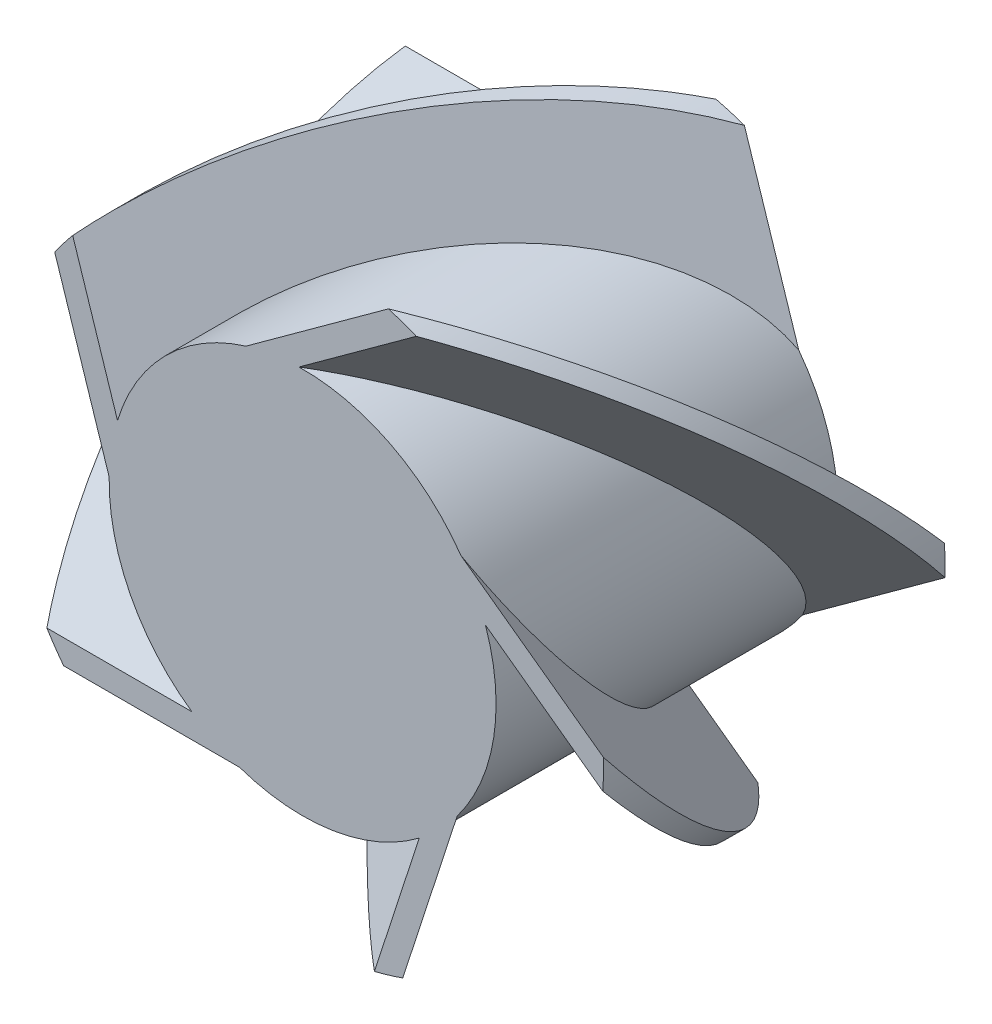
ISO-10303-21;
HEADER;
FILE_DESCRIPTION(('STEP AP214'),'2;1');
FILE_NAME('part.step','',(''),(''),'','','');
FILE_SCHEMA(('AUTOMOTIVE_DESIGN { 1 0 10303 214 1 1 1 1 }'));
ENDSEC;
DATA;
#1=APPLICATION_CONTEXT('core data for automotive mechanical design processes');
#2=APPLICATION_PROTOCOL_DEFINITION('international standard','automotive_design',2000,#1);
#3=PRODUCT_CONTEXT('',#1,'mechanical');
#4=PRODUCT('Part','Part','',(#3));
#5=PRODUCT_RELATED_PRODUCT_CATEGORY('part','',(#4));
#6=PRODUCT_DEFINITION_FORMATION('','',#4);
#7=PRODUCT_DEFINITION_CONTEXT('part definition',#1,'design');
#8=PRODUCT_DEFINITION('design','',#6,#7);
#9=PRODUCT_DEFINITION_SHAPE('','',#8);
#10=(LENGTH_UNIT() NAMED_UNIT(*) SI_UNIT(.MILLI.,.METRE.));
#11=(NAMED_UNIT(*) PLANE_ANGLE_UNIT() SI_UNIT($,.RADIAN.));
#12=(NAMED_UNIT(*) SI_UNIT($,.STERADIAN.) SOLID_ANGLE_UNIT());
#13=UNCERTAINTY_MEASURE_WITH_UNIT(LENGTH_MEASURE(1.E-05),#10,'distance_accuracy_value','');
#14=(GEOMETRIC_REPRESENTATION_CONTEXT(3) GLOBAL_UNCERTAINTY_ASSIGNED_CONTEXT((#13)) GLOBAL_UNIT_ASSIGNED_CONTEXT((#10,
#11,#12)) REPRESENTATION_CONTEXT('',''));
#15=CARTESIAN_POINT('',(0.,0.,0.));
#16=DIRECTION('',(0.,0.,1.));
#17=DIRECTION('',(1.,0.,0.));
#18=AXIS2_PLACEMENT_3D('',#15,#16,#17);
#19=CARTESIAN_POINT('',(13.0974737134332,10.2910778197719,47.7012));
#20=DIRECTION('',(0.,0.,1.));
#21=DIRECTION('',(1.,0.,0.));
#22=AXIS2_PLACEMENT_3D('',#19,#20,#21);
#23=PLANE('',#22);
#24=CARTESIAN_POINT('',(31.496,30.988,47.7012));
#25=DIRECTION('',(0.,0.,1.));
#26=DIRECTION('',(1.,0.,0.));
#27=AXIS2_PLACEMENT_3D('',#24,#25,#26);
#28=CIRCLE('',#27,17.78);
#29=CARTESIAN_POINT('',(37.4130205696061,14.2214479519831,47.7012));
#30=VERTEX_POINT('',#29);
#31=CARTESIAN_POINT('',(35.7399307124631,13.721921924542,47.7012));
#32=VERTEX_POINT('',#31);
#33=EDGE_CURVE('E251',#30,#32,#28,.F.);
#34=ORIENTED_EDGE('',*,*,#33,.F.);
#35=DIRECTION('',(-0.30901699437494,-0.951056516295156,0.));
#36=VECTOR('',#35,1.);
#37=CARTESIAN_POINT('',(38.4614674875628,17.448235770981,47.7012));
#38=LINE('',#37,#36);
#39=CARTESIAN_POINT('',(40.6267949705005,24.1124285178116,47.7012));
#40=VERTEX_POINT('',#39);
#41=EDGE_CURVE('E167',#40,#30,#38,.T.);
#42=ORIENTED_EDGE('',*,*,#41,.F.);
#43=CARTESIAN_POINT('',(31.496,30.988,47.7012));
#44=DIRECTION('',(0.,0.,1.));
#45=DIRECTION('',(0.,-1.,0.));
#46=AXIS2_PLACEMENT_3D('',#43,#44,#45);
#47=CIRCLE('',#46,11.43);
#48=CARTESIAN_POINT('',(42.2982554358267,34.7237967689843,47.7012));
#49=VERTEX_POINT('',#48);
#50=EDGE_CURVE('E151',#49,#40,#47,.F.);
#51=ORIENTED_EDGE('',*,*,#50,.F.);
#52=DIRECTION('',(-0.809016994374946,0.587785252292475,0.));
#53=VECTOR('',#52,1.);
#54=CARTESIAN_POINT('',(44.8765476119103,32.850557853436,47.7012));
#55=LINE('',#54,#53);
#56=CARTESIAN_POINT('',(49.2284627776261,29.688706407272,47.7012));
#57=VERTEX_POINT('',#56);
#58=EDGE_CURVE('E165',#57,#49,#55,.T.);
#59=ORIENTED_EDGE('',*,*,#58,.F.);
#60=CARTESIAN_POINT('',(31.496,30.988,47.7012));
#61=DIRECTION('',(0.,0.,1.));
#62=DIRECTION('',(1.,0.,0.));
#63=AXIS2_PLACEMENT_3D('',#60,#61,#62);
#64=CIRCLE('',#63,17.78);
#65=CARTESIAN_POINT('',(49.2703984931427,31.4342714498669,47.7012));
#66=VERTEX_POINT('',#65);
#67=EDGE_CURVE('E257',#66,#57,#64,.F.);
#68=ORIENTED_EDGE('',*,*,#67,.F.);
#69=DIRECTION('',(0.809016994374948,-0.587785252292472,0.));
#70=VECTOR('',#69,1.);
#71=CARTESIAN_POINT('',(45.9521577980181,33.845114433033,47.7012));
#72=LINE('',#71,#70);
#73=CARTESIAN_POINT('',(40.8566278794263,37.5472336216136,47.7012));
#74=VERTEX_POINT('',#73);
#75=EDGE_CURVE('E177',#74,#66,#72,.T.);
#76=ORIENTED_EDGE('',*,*,#75,.F.);
#77=CARTESIAN_POINT('',(31.496,30.988,47.7012));
#78=DIRECTION('',(0.,0.,1.));
#79=DIRECTION('',(1.,0.,0.));
#80=AXIS2_PLACEMENT_3D('',#77,#78,#79);
#81=CIRCLE('',#80,11.43);
#82=CARTESIAN_POINT('',(31.2811266465527,42.4159801120749,47.7012));
#83=VERTEX_POINT('',#82);
#84=EDGE_CURVE('E20',#74,#83,#81,.T.);
#85=ORIENTED_EDGE('',*,*,#84,.T.);
#86=DIRECTION('',(-0.809016994374949,-0.587785252292471,0.));
#87=VECTOR('',#86,1.);
#88=CARTESIAN_POINT('',(34.0904750711804,44.4570912185518,47.7012));
#89=LINE('',#88,#87);
#90=CARTESIAN_POINT('',(38.2113339883522,47.4510704737872,47.7012));
#91=VERTEX_POINT('',#90);
#92=EDGE_CURVE('E263',#91,#83,#89,.T.);
#93=ORIENTED_EDGE('',*,*,#92,.F.);
#94=CARTESIAN_POINT('',(31.496,30.988,47.7012));
#95=DIRECTION('',(0.,0.,1.));
#96=DIRECTION('',(0.,-1.,0.));
#97=AXIS2_PLACEMENT_3D('',#94,#95,#96);
#98=CIRCLE('',#97,17.78);
#99=CARTESIAN_POINT('',(36.5641618287412,48.0303629722433,47.7012));
#100=VERTEX_POINT('',#99);
#101=EDGE_CURVE('E301',#91,#100,#98,.T.);
#102=ORIENTED_EDGE('',*,*,#101,.T.);
#103=DIRECTION('',(0.809016994374949,0.587785252292471,0.));
#104=VECTOR('',#103,1.);
#105=CARTESIAN_POINT('',(33.0148648850726,45.4516477981487,47.7012));
#106=LINE('',#105,#104);
#107=CARTESIAN_POINT('',(28.1503912150248,41.9174008004967,47.7012));
#108=VERTEX_POINT('',#107);
#109=EDGE_CURVE('E272',#108,#100,#106,.T.);
#110=ORIENTED_EDGE('',*,*,#109,.F.);
#111=CARTESIAN_POINT('',(31.496,30.988,47.7012));
#112=DIRECTION('',(0.,0.,1.));
#113=DIRECTION('',(0.,-1.,0.));
#114=AXIS2_PLACEMENT_3D('',#111,#112,#113);
#115=CIRCLE('',#114,11.43);
#116=CARTESIAN_POINT('',(20.5609455284663,34.3150833630358,47.7012));
#117=VERTEX_POINT('',#116);
#118=EDGE_CURVE('E273',#117,#108,#115,.F.);
#119=ORIENTED_EDGE('',*,*,#118,.F.);
#120=DIRECTION('',(0.309016994374947,-0.951056516295154,0.));
#121=VECTOR('',#120,1.);
#122=CARTESIAN_POINT('',(19.2688616717718,38.2917085774343,47.7012));
#123=LINE('',#122,#121);
#124=CARTESIAN_POINT('',(17.9138418729829,42.4620307047133,47.7012));
#125=VERTEX_POINT('',#124);
#126=EDGE_CURVE('E279',#125,#117,#123,.T.);
#127=ORIENTED_EDGE('',*,*,#126,.F.);
#128=CARTESIAN_POINT('',(31.496,30.988,47.7012));
#129=DIRECTION('',(0.,0.,1.));
#130=DIRECTION('',(1.,0.,0.));
#131=AXIS2_PLACEMENT_3D('',#128,#129,#130);
#132=CIRCLE('',#131,17.78);
#133=CARTESIAN_POINT('',(16.8538977775041,41.0744881155921,47.7012));
#134=VERTEX_POINT('',#133);
#135=EDGE_CURVE('E283',#134,#125,#132,.F.);
#136=ORIENTED_EDGE('',*,*,#135,.F.);
#137=DIRECTION('',(-0.309016994374948,0.951056516295153,0.));
#138=VECTOR('',#137,1.);
#139=CARTESIAN_POINT('',(18.2110260043969,36.8976769138484,47.7012));
#140=LINE('',#139,#138);
#141=CARTESIAN_POINT('',(20.0676721783987,31.1835075497634,47.7012));
#142=VERTEX_POINT('',#141);
#143=EDGE_CURVE('E288',#142,#134,#140,.T.);
#144=ORIENTED_EDGE('',*,*,#143,.F.);
#145=CARTESIAN_POINT('',(31.496,30.988,47.7012));
#146=DIRECTION('',(0.,0.,1.));
#147=DIRECTION('',(0.,-1.,0.));
#148=AXIS2_PLACEMENT_3D('',#145,#146,#147);
#149=CIRCLE('',#148,11.43);
#150=CARTESIAN_POINT('',(24.952638021208,21.6162704896855,47.7012));
#151=VERTEX_POINT('',#150);
#152=EDGE_CURVE('E294',#151,#142,#149,.F.);
#153=ORIENTED_EDGE('',*,*,#152,.F.);
#154=DIRECTION('',(1.,0.,0.));
#155=VECTOR('',#154,1.);
#156=CARTESIAN_POINT('',(20.7472568783248,21.6162704896855,47.7012));
#157=LINE('',#156,#155);
#158=CARTESIAN_POINT('',(16.3864306485757,21.6162704896855,47.7012));
#159=VERTEX_POINT('',#158);
#160=EDGE_CURVE('E296',#159,#151,#157,.T.);
#161=ORIENTED_EDGE('',*,*,#160,.F.);
#162=CARTESIAN_POINT('',(31.496,30.988,47.7012));
#163=DIRECTION('',(0.,0.,1.));
#164=DIRECTION('',(1.,0.,0.));
#165=AXIS2_PLACEMENT_3D('',#162,#163,#164);
#166=CIRCLE('',#165,17.78);
#167=CARTESIAN_POINT('',(17.3785213310061,20.1794295103145,47.7012));
#168=VERTEX_POINT('',#167);
#169=EDGE_CURVE('E300',#168,#159,#166,.F.);
#170=ORIENTED_EDGE('',*,*,#169,.F.);
#171=DIRECTION('',(-1.,0.,0.));
#172=VECTOR('',#171,1.);
#173=CARTESIAN_POINT('',(20.7472568783248,20.1794295103144,47.7012));
#174=LINE('',#173,#172);
#175=CARTESIAN_POINT('',(27.7785137566497,20.1794295103145,47.7012));
#176=VERTEX_POINT('',#175);
#177=EDGE_CURVE('E185',#176,#168,#174,.T.);
#178=ORIENTED_EDGE('',*,*,#177,.F.);
#179=CARTESIAN_POINT('',(31.496,30.988,47.7012));
#180=DIRECTION('',(0.,0.,1.));
#181=DIRECTION('',(0.,-1.,0.));
#182=AXIS2_PLACEMENT_3D('',#179,#180,#181);
#183=CIRCLE('',#182,11.43);
#184=CARTESIAN_POINT('',(38.3870343679465,21.8688692662195,47.7012));
#185=VERTEX_POINT('',#184);
#186=EDGE_CURVE('E189',#185,#176,#183,.F.);
#187=ORIENTED_EDGE('',*,*,#186,.F.);
#188=DIRECTION('',(0.309016994374948,0.951056516295153,0.));
#189=VECTOR('',#188,1.);
#190=CARTESIAN_POINT('',(37.403631820188,18.8422674345668,47.7012000000001));
#191=LINE('',#190,#189);
#192=EDGE_CURVE('E181',#32,#185,#191,.T.);
#193=ORIENTED_EDGE('',*,*,#192,.F.);
#194=EDGE_LOOP('',(#34,#42,#51,#59,#68,#76,#85,#93,#102,#110,#119,#127,#136,#144,#153,#161,#170,
#178,#187,#193));
#195=FACE_BOUND('',#194,.T.);
#196=ADVANCED_FACE('F16',(#195),#23,.T.);
#197=CARTESIAN_POINT('',(31.496,30.988,38.3943219126236));
#198=DIRECTION('',(0.,0.,1.));
#199=DIRECTION('',(1.,0.,0.));
#200=AXIS2_PLACEMENT_3D('',#197,#198,#199);
#201=CYLINDRICAL_SURFACE('',#200,17.78);
#202=CARTESIAN_POINT('',(31.496,30.988,27.5208999999999));
#203=DIRECTION('',(0.,0.,1.));
#204=DIRECTION('',(1.,0.,0.));
#205=AXIS2_PLACEMENT_3D('',#202,#203,#204);
#206=CIRCLE('',#205,17.78);
#207=CARTESIAN_POINT('',(16.3864306485758,40.3597295103146,27.5209));
#208=VERTEX_POINT('',#207);
#209=CARTESIAN_POINT('',(17.3785213310061,41.7965704896855,27.5209));
#210=VERTEX_POINT('',#209);
#211=EDGE_CURVE('E194',#208,#210,#206,.F.);
#212=ORIENTED_EDGE('',*,*,#211,.F.);
#213=CARTESIAN_POINT('',(31.496,30.988,36.8926295103145));
#214=DIRECTION('',(0.,-0.707106781186547,-0.707106781186548));
#215=DIRECTION('',(0.,-0.707106781186548,0.707106781186547));
#216=AXIS2_PLACEMENT_3D('',#213,#214,#215);
#217=ELLIPSE('',#216,25.1447171389936,17.78);
#218=EDGE_CURVE('E188',#168,#208,#217,.T.);
#219=ORIENTED_EDGE('',*,*,#218,.F.);
#220=ORIENTED_EDGE('',*,*,#169,.T.);
#221=CARTESIAN_POINT('',(31.496,30.988,38.3294704896855));
#222=DIRECTION('',(0.,0.707106781186548,0.707106781186547));
#223=DIRECTION('',(0.,-0.707106781186547,0.707106781186548));
#224=AXIS2_PLACEMENT_3D('',#221,#222,#223);
#225=ELLIPSE('',#224,25.1447171389937,17.78);
#226=EDGE_CURVE('E297',#210,#159,#225,.T.);
#227=ORIENTED_EDGE('',*,*,#226,.F.);
#228=EDGE_LOOP('',(#212,#219,#220,#227));
#229=FACE_BOUND('',#228,.T.);
#230=ADVANCED_FACE('F337',(#229),#201,.T.);
#231=CARTESIAN_POINT('',(12.309748624335,43.8146004896855,25.50287));
#232=DIRECTION('',(0.,0.707106781186548,0.707106781186547));
#233=DIRECTION('',(0.,-0.707106781186547,0.707106781186548));
#234=AXIS2_PLACEMENT_3D('',#231,#232,#233);
#235=PLANE('',#234);
#236=ORIENTED_EDGE('',*,*,#160,.T.);
#237=CARTESIAN_POINT('',(31.496,30.988,38.3294704896855));
#238=DIRECTION('',(0.,0.707106781186548,0.707106781186547));
#239=DIRECTION('',(0.,-0.707106781186547,0.707106781186548));
#240=AXIS2_PLACEMENT_3D('',#237,#238,#239);
#241=ELLIPSE('',#240,16.1644610179245,11.43);
#242=CARTESIAN_POINT('',(27.7785137566494,41.7965704896855,27.5209));
#243=VERTEX_POINT('',#242);
#244=EDGE_CURVE('E292',#243,#151,#241,.T.);
#245=ORIENTED_EDGE('',*,*,#244,.F.);
#246=DIRECTION('',(1.,0.,0.));
#247=VECTOR('',#246,1.);
#248=CARTESIAN_POINT('',(32.8312153242878,41.7965704896855,27.5209));
#249=LINE('',#248,#247);
#250=EDGE_CURVE('E190',#210,#243,#249,.T.);
#251=ORIENTED_EDGE('',*,*,#250,.F.);
#252=ORIENTED_EDGE('',*,*,#226,.T.);
#253=EDGE_LOOP('',(#236,#245,#251,#252));
#254=FACE_BOUND('',#253,.T.);
#255=ADVANCED_FACE('F323',(#254),#235,.T.);
#256=CARTESIAN_POINT('',(31.496,30.988,47.7012000000001));
#257=DIRECTION('',(0.,0.,1.));
#258=DIRECTION('',(0.,-1.,0.));
#259=AXIS2_PLACEMENT_3D('',#256,#257,#258);
#260=CYLINDRICAL_SURFACE('',#259,11.43);
#261=CARTESIAN_POINT('',(31.496,30.988,27.5209000000001));
#262=DIRECTION('',(0.,0.,1.));
#263=DIRECTION('',(0.,-1.,0.));
#264=AXIS2_PLACEMENT_3D('',#261,#262,#263);
#265=CIRCLE('',#264,11.43);
#266=CARTESIAN_POINT('',(38.3870343679465,40.1071307337805,27.5209000000001));
#267=VERTEX_POINT('',#266);
#268=EDGE_CURVE('E193',#243,#267,#265,.F.);
#269=ORIENTED_EDGE('',*,*,#268,.F.);
#270=ORIENTED_EDGE('',*,*,#244,.T.);
#271=ORIENTED_EDGE('',*,*,#152,.T.);
#272=CARTESIAN_POINT('',(31.496,30.988,36.8926295103144));
#273=DIRECTION('',(-0.672498511963957,-0.218508012224411,-0.707106781186548));
#274=DIRECTION('',(-0.672498511963958,-0.218508012224411,0.707106781186547));
#275=AXIS2_PLACEMENT_3D('',#272,#273,#274);
#276=ELLIPSE('',#275,16.1644610179245,11.43);
#277=EDGE_CURVE('E289',#267,#142,#276,.F.);
#278=ORIENTED_EDGE('',*,*,#277,.F.);
#279=EDGE_LOOP('',(#269,#270,#271,#278));
#280=FACE_BOUND('',#279,.T.);
#281=ADVANCED_FACE('F332',(#280),#260,.T.);
#282=CARTESIAN_POINT('',(10.2391324345243,49.0311539240388,51.5334707298321));
#283=DIRECTION('',(-0.672498511963957,-0.218508012224411,-0.707106781186548));
#284=DIRECTION('',(0.672498511963958,0.218508012224412,-0.707106781186547));
#285=AXIS2_PLACEMENT_3D('',#282,#283,#284);
#286=PLANE('',#285);
#287=CARTESIAN_POINT('',(31.496,30.988,36.8926295103144));
#288=DIRECTION('',(-0.672498511963957,-0.218508012224411,-0.707106781186548));
#289=DIRECTION('',(-0.672498511963958,-0.218508012224411,0.707106781186547));
#290=AXIS2_PLACEMENT_3D('',#287,#288,#289);
#291=ELLIPSE('',#290,25.1447171389936,17.78);
#292=CARTESIAN_POINT('',(35.7399307124632,48.254078075458,27.5209));
#293=VERTEX_POINT('',#292);
#294=EDGE_CURVE('E285',#293,#134,#291,.F.);
#295=ORIENTED_EDGE('',*,*,#294,.F.);
#296=DIRECTION('',(-0.309016994374954,0.951056516295151,0.));
#297=VECTOR('',#296,1.);
#298=CARTESIAN_POINT('',(38.3870343679466,40.1071307337805,27.5209));
#299=LINE('',#298,#297);
#300=EDGE_CURVE('E237',#267,#293,#299,.T.);
#301=ORIENTED_EDGE('',*,*,#300,.F.);
#302=ORIENTED_EDGE('',*,*,#277,.T.);
#303=ORIENTED_EDGE('',*,*,#143,.T.);
#304=EDGE_LOOP('',(#295,#301,#302,#303));
#305=FACE_BOUND('',#304,.T.);
#306=ADVANCED_FACE('F378',(#305),#286,.T.);
#307=CARTESIAN_POINT('',(31.496,30.988,47.7012000000001));
#308=DIRECTION('',(0.,0.,1.));
#309=DIRECTION('',(1.,0.,0.));
#310=AXIS2_PLACEMENT_3D('',#307,#308,#309);
#311=CYLINDRICAL_SURFACE('',#310,17.78);
#312=CARTESIAN_POINT('',(31.496,30.988,38.3294704896856));
#313=DIRECTION('',(0.67249851196396,0.218508012224412,0.707106781186545));
#314=DIRECTION('',(-0.672498511963954,-0.218508012224411,0.70710678118655));
#315=AXIS2_PLACEMENT_3D('',#312,#313,#314);
#316=ELLIPSE('',#315,25.1447171389937,17.78);
#317=CARTESIAN_POINT('',(37.413020569606,47.7545520480169,27.5209));
#318=VERTEX_POINT('',#317);
#319=EDGE_CURVE('E280',#318,#125,#316,.T.);
#320=ORIENTED_EDGE('',*,*,#319,.F.);
#321=CARTESIAN_POINT('',(31.496,30.988,27.5208999999999));
#322=DIRECTION('',(0.,0.,1.));
#323=DIRECTION('',(1.,0.,0.));
#324=AXIS2_PLACEMENT_3D('',#321,#322,#323);
#325=CIRCLE('',#324,17.78);
#326=EDGE_CURVE('E234',#293,#318,#325,.F.);
#327=ORIENTED_EDGE('',*,*,#326,.F.);
#328=ORIENTED_EDGE('',*,*,#294,.T.);
#329=ORIENTED_EDGE('',*,*,#135,.T.);
#330=EDGE_LOOP('',(#320,#327,#328,#329));
#331=FACE_BOUND('',#330,.T.);
#332=ADVANCED_FACE('F376',(#331),#311,.T.);
#333=CARTESIAN_POINT('',(38.4131515748671,57.6115515341237,23.5237385355454));
#334=DIRECTION('',(0.67249851196396,0.218508012224412,0.707106781186545));
#335=DIRECTION('',(-0.672498511963956,-0.218508012224407,0.70710678118655));
#336=AXIS2_PLACEMENT_3D('',#333,#334,#335);
#337=PLANE('',#336);
#338=ORIENTED_EDGE('',*,*,#319,.T.);
#339=ORIENTED_EDGE('',*,*,#126,.T.);
#340=CARTESIAN_POINT('',(31.496,30.988,38.3294704896856));
#341=DIRECTION('',(0.67249851196396,0.218508012224412,0.707106781186545));
#342=DIRECTION('',(-0.672498511963955,-0.21850801222441,0.70710678118655));
#343=AXIS2_PLACEMENT_3D('',#340,#341,#342);
#344=ELLIPSE('',#343,16.1644610179245,11.43);
#345=CARTESIAN_POINT('',(40.6267949705004,37.8635714821885,27.5209));
#346=VERTEX_POINT('',#345);
#347=EDGE_CURVE('E276',#346,#117,#344,.T.);
#348=ORIENTED_EDGE('',*,*,#347,.F.);
#349=DIRECTION('',(0.30901699437494,-0.951056516295156,0.));
#350=VECTOR('',#349,1.);
#351=CARTESIAN_POINT('',(37.413020569606,47.7545520480168,27.5209));
#352=LINE('',#351,#350);
#353=EDGE_CURVE('E231',#318,#346,#352,.T.);
#354=ORIENTED_EDGE('',*,*,#353,.F.);
#355=EDGE_LOOP('',(#338,#339,#348,#354));
#356=FACE_BOUND('',#355,.T.);
#357=ADVANCED_FACE('F373',(#356),#337,.T.);
#358=CARTESIAN_POINT('',(31.496,30.988,30.1901641410712));
#359=DIRECTION('',(0.,0.,1.));
#360=DIRECTION('',(0.,-1.,0.));
#361=AXIS2_PLACEMENT_3D('',#358,#359,#360);
#362=CYLINDRICAL_SURFACE('',#361,11.43);
#363=CARTESIAN_POINT('',(31.496,30.988,36.8926295103145));
#364=DIRECTION('',(-0.415626937777452,0.572061402817686,-0.707106781186547));
#365=DIRECTION('',(-0.415626937777452,0.572061402817685,0.707106781186548));
#366=AXIS2_PLACEMENT_3D('',#363,#364,#365);
#367=ELLIPSE('',#366,16.1644610179245,11.43);
#368=CARTESIAN_POINT('',(42.2982554358267,27.2522032310157,27.5209));
#369=VERTEX_POINT('',#368);
#370=EDGE_CURVE('E267',#369,#108,#367,.F.);
#371=ORIENTED_EDGE('',*,*,#370,.F.);
#372=CARTESIAN_POINT('',(31.496,30.988,27.5209));
#373=DIRECTION('',(0.,0.,1.));
#374=DIRECTION('',(0.,-1.,0.));
#375=AXIS2_PLACEMENT_3D('',#372,#373,#374);
#376=CIRCLE('',#375,11.43);
#377=EDGE_CURVE('E228',#346,#369,#376,.F.);
#378=ORIENTED_EDGE('',*,*,#377,.F.);
#379=ORIENTED_EDGE('',*,*,#347,.T.);
#380=ORIENTED_EDGE('',*,*,#118,.T.);
#381=EDGE_LOOP('',(#371,#378,#379,#380));
#382=FACE_BOUND('',#381,.T.);
#383=ADVANCED_FACE('F370',(#382),#362,.T.);
#384=CARTESIAN_POINT('',(44.3160202161976,59.7707237349858,52.6429233391449));
#385=DIRECTION('',(-0.415626937777452,0.572061402817686,-0.707106781186547));
#386=DIRECTION('',(0.415626937777453,-0.572061402817683,-0.707106781186548));
#387=AXIS2_PLACEMENT_3D('',#384,#385,#386);
#388=PLANE('',#387);
#389=DIRECTION('',(0.809016994374946,0.587785252292475,0.));
#390=VECTOR('',#389,1.);
#391=CARTESIAN_POINT('',(42.2982554358267,27.2522032310156,27.5209));
#392=LINE('',#391,#390);
#393=CARTESIAN_POINT('',(49.2284627776261,32.2872935927279,27.5209));
#394=VERTEX_POINT('',#393);
#395=EDGE_CURVE('E225',#369,#394,#392,.T.);
#396=ORIENTED_EDGE('',*,*,#395,.F.);
#397=ORIENTED_EDGE('',*,*,#370,.T.);
#398=ORIENTED_EDGE('',*,*,#109,.T.);
#399=CARTESIAN_POINT('',(31.496,30.988,36.8926295103145));
#400=DIRECTION('',(-0.415626937777452,0.572061402817686,-0.707106781186547));
#401=DIRECTION('',(-0.415626937777452,0.572061402817685,0.707106781186548));
#402=AXIS2_PLACEMENT_3D('',#399,#400,#401);
#403=ELLIPSE('',#402,25.1447171389937,17.78);
#404=EDGE_CURVE('E269',#100,#394,#403,.T.);
#405=ORIENTED_EDGE('',*,*,#404,.T.);
#406=EDGE_LOOP('',(#396,#397,#398,#405));
#407=FACE_BOUND('',#406,.T.);
#408=ADVANCED_FACE('F365',(#407),#388,.T.);
#409=CARTESIAN_POINT('',(31.496,30.988,27.8807951961489));
#410=DIRECTION('',(0.,0.,1.));
#411=DIRECTION('',(1.,0.,0.));
#412=AXIS2_PLACEMENT_3D('',#409,#410,#411);
#413=CYLINDRICAL_SURFACE('',#412,17.78);
#414=CARTESIAN_POINT('',(31.496,30.988,38.3294704896855));
#415=DIRECTION('',(0.415626937777454,-0.572061402817685,0.707106781186547));
#416=DIRECTION('',(-0.415626937777453,0.572061402817684,0.707106781186548));
#417=AXIS2_PLACEMENT_3D('',#414,#415,#416);
#418=ELLIPSE('',#417,25.1447171389937,17.78);
#419=CARTESIAN_POINT('',(49.2703984931427,30.541728550133,27.5209));
#420=VERTEX_POINT('',#419);
#421=EDGE_CURVE('E264',#420,#91,#418,.T.);
#422=ORIENTED_EDGE('',*,*,#421,.F.);
#423=CARTESIAN_POINT('',(31.496,30.988,27.5208999999999));
#424=DIRECTION('',(0.,0.,1.));
#425=DIRECTION('',(1.,0.,0.));
#426=AXIS2_PLACEMENT_3D('',#423,#424,#425);
#427=CIRCLE('',#426,17.78);
#428=EDGE_CURVE('E222',#394,#420,#427,.F.);
#429=ORIENTED_EDGE('',*,*,#428,.F.);
#430=ORIENTED_EDGE('',*,*,#404,.F.);
#431=ORIENTED_EDGE('',*,*,#101,.F.);
#432=EDGE_LOOP('',(#422,#429,#430,#431));
#433=FACE_BOUND('',#432,.T.);
#434=ADVANCED_FACE('F363',(#433),#413,.T.);
#435=CARTESIAN_POINT('',(62.4932265062432,34.038131115847,22.5773657951385));
#436=DIRECTION('',(0.415626937777454,-0.572061402817685,0.707106781186547));
#437=DIRECTION('',(-0.41562693777745,0.572061402817686,0.707106781186548));
#438=AXIS2_PLACEMENT_3D('',#435,#436,#437);
#439=PLANE('',#438);
#440=ORIENTED_EDGE('',*,*,#92,.T.);
#441=CARTESIAN_POINT('',(31.496,30.988,38.3294704896856));
#442=DIRECTION('',(0.415626937777454,-0.572061402817685,0.707106781186547));
#443=DIRECTION('',(-0.415626937777453,0.572061402817684,0.707106781186548));
#444=AXIS2_PLACEMENT_3D('',#441,#442,#443);
#445=ELLIPSE('',#444,16.1644610179245,11.43);
#446=CARTESIAN_POINT('',(40.8566278794263,24.4287663783863,27.5209000000001));
#447=VERTEX_POINT('',#446);
#448=EDGE_CURVE('E261',#447,#83,#445,.T.);
#449=ORIENTED_EDGE('',*,*,#448,.F.);
#450=DIRECTION('',(-0.809016994374944,-0.587785252292477,0.));
#451=VECTOR('',#450,1.);
#452=CARTESIAN_POINT('',(49.2703984931426,30.5417285501329,27.5209));
#453=LINE('',#452,#451);
#454=EDGE_CURVE('E219',#420,#447,#453,.T.);
#455=ORIENTED_EDGE('',*,*,#454,.F.);
#456=ORIENTED_EDGE('',*,*,#421,.T.);
#457=EDGE_LOOP('',(#440,#449,#455,#456));
#458=FACE_BOUND('',#457,.T.);
#459=ADVANCED_FACE('F312',(#458),#439,.T.);
#460=CARTESIAN_POINT('',(31.496,30.988,43.7075556336816));
#461=DIRECTION('',(0.,0.,1.));
#462=DIRECTION('',(0.,-1.,0.));
#463=AXIS2_PLACEMENT_3D('',#460,#461,#462);
#464=CYLINDRICAL_SURFACE('',#463,11.43);
#465=CARTESIAN_POINT('',(31.496,30.988,27.5209000000001));
#466=DIRECTION('',(0.,0.,1.));
#467=DIRECTION('',(0.,-1.,0.));
#468=AXIS2_PLACEMENT_3D('',#465,#466,#467);
#469=CIRCLE('',#468,11.43);
#470=CARTESIAN_POINT('',(31.2811266465528,19.5600198879251,27.5209));
#471=VERTEX_POINT('',#470);
#472=EDGE_CURVE('E216',#447,#471,#469,.F.);
#473=ORIENTED_EDGE('',*,*,#472,.F.);
#474=ORIENTED_EDGE('',*,*,#448,.T.);
#475=ORIENTED_EDGE('',*,*,#84,.F.);
#476=CARTESIAN_POINT('',(31.496,30.988,36.8926295103145));
#477=DIRECTION('',(0.415626937777453,0.572061402817686,-0.707106781186547));
#478=DIRECTION('',(0.415626937777452,0.572061402817684,0.707106781186549));
#479=AXIS2_PLACEMENT_3D('',#476,#477,#478);
#480=ELLIPSE('',#479,16.1644610179245,11.43);
#481=EDGE_CURVE('E259',#471,#74,#480,.F.);
#482=ORIENTED_EDGE('',*,*,#481,.F.);
#483=EDGE_LOOP('',(#473,#474,#475,#482));
#484=FACE_BOUND('',#483,.T.);
#485=ADVANCED_FACE('F359',(#484),#464,.T.);
#486=CARTESIAN_POINT('',(62.4932265062432,27.937868884153,52.6447342048615));
#487=DIRECTION('',(0.415626937777453,0.572061402817686,-0.707106781186547));
#488=DIRECTION('',(-0.41562693777745,-0.572061402817686,-0.707106781186548));
#489=AXIS2_PLACEMENT_3D('',#486,#487,#488);
#490=PLANE('',#489);
#491=DIRECTION('',(0.809016994374945,-0.587785252292476,0.));
#492=VECTOR('',#491,1.);
#493=CARTESIAN_POINT('',(31.2811266465527,19.5600198879251,27.5209));
#494=LINE('',#493,#492);
#495=CARTESIAN_POINT('',(38.2113339883521,14.5249295262128,27.5209));
#496=VERTEX_POINT('',#495);
#497=EDGE_CURVE('E213',#471,#496,#494,.T.);
#498=ORIENTED_EDGE('',*,*,#497,.F.);
#499=ORIENTED_EDGE('',*,*,#481,.T.);
#500=ORIENTED_EDGE('',*,*,#75,.T.);
#501=CARTESIAN_POINT('',(31.496,30.988,36.8926295103145));
#502=DIRECTION('',(0.415626937777453,0.572061402817686,-0.707106781186547));
#503=DIRECTION('',(0.415626937777452,0.572061402817684,0.707106781186548));
#504=AXIS2_PLACEMENT_3D('',#501,#502,#503);
#505=ELLIPSE('',#504,25.1447171389937,17.78);
#506=EDGE_CURVE('E173',#496,#66,#505,.F.);
#507=ORIENTED_EDGE('',*,*,#506,.F.);
#508=EDGE_LOOP('',(#498,#499,#500,#507));
#509=FACE_BOUND('',#508,.T.);
#510=ADVANCED_FACE('F358',(#509),#490,.T.);
#511=CARTESIAN_POINT('',(31.496,30.988,47.7012));
#512=DIRECTION('',(0.,0.,1.));
#513=DIRECTION('',(1.,0.,0.));
#514=AXIS2_PLACEMENT_3D('',#511,#512,#513);
#515=CYLINDRICAL_SURFACE('',#514,17.78);
#516=CARTESIAN_POINT('',(31.496,30.988,27.5208999999999));
#517=DIRECTION('',(0.,0.,1.));
#518=DIRECTION('',(1.,0.,0.));
#519=AXIS2_PLACEMENT_3D('',#516,#517,#518);
#520=CIRCLE('',#519,17.78);
#521=CARTESIAN_POINT('',(36.5641618287411,13.9456370277566,27.5209));
#522=VERTEX_POINT('',#521);
#523=EDGE_CURVE('E210',#496,#522,#520,.F.);
#524=ORIENTED_EDGE('',*,*,#523,.F.);
#525=ORIENTED_EDGE('',*,*,#506,.T.);
#526=ORIENTED_EDGE('',*,*,#67,.T.);
#527=CARTESIAN_POINT('',(31.496,30.988,38.3294704896856));
#528=DIRECTION('',(-0.415626937777454,-0.572061402817686,0.707106781186546));
#529=DIRECTION('',(0.415626937777452,0.572061402817684,0.707106781186549));
#530=AXIS2_PLACEMENT_3D('',#527,#528,#529);
#531=ELLIPSE('',#530,25.1447171389937,17.78);
#532=EDGE_CURVE('E171',#522,#57,#531,.T.);
#533=ORIENTED_EDGE('',*,*,#532,.F.);
#534=EDGE_LOOP('',(#524,#525,#526,#533));
#535=FACE_BOUND('',#534,.T.);
#536=ADVANCED_FACE('F356',(#535),#515,.T.);
#537=CARTESIAN_POINT('',(44.3160202161976,2.20527626501421,22.5791766608552));
#538=DIRECTION('',(-0.415626937777454,-0.572061402817686,0.707106781186546));
#539=DIRECTION('',(0.415626937777453,0.572061402817683,0.707106781186549));
#540=AXIS2_PLACEMENT_3D('',#537,#538,#539);
#541=PLANE('',#540);
#542=ORIENTED_EDGE('',*,*,#58,.T.);
#543=CARTESIAN_POINT('',(31.496,30.988,38.3294704896856));
#544=DIRECTION('',(-0.415626937777454,-0.572061402817686,0.707106781186546));
#545=DIRECTION('',(0.415626937777452,0.572061402817684,0.707106781186549));
#546=AXIS2_PLACEMENT_3D('',#543,#544,#545);
#547=ELLIPSE('',#546,16.1644610179245,11.43);
#548=CARTESIAN_POINT('',(28.1503912150248,20.0585991995034,27.5209));
#549=VERTEX_POINT('',#548);
#550=EDGE_CURVE('E148',#549,#49,#547,.T.);
#551=ORIENTED_EDGE('',*,*,#550,.F.);
#552=DIRECTION('',(-0.809016994374948,0.587785252292473,0.));
#553=VECTOR('',#552,1.);
#554=CARTESIAN_POINT('',(36.5641618287412,13.9456370277567,27.5209));
#555=LINE('',#554,#553);
#556=EDGE_CURVE('E208',#522,#549,#555,.T.);
#557=ORIENTED_EDGE('',*,*,#556,.F.);
#558=ORIENTED_EDGE('',*,*,#532,.T.);
#559=EDGE_LOOP('',(#542,#551,#557,#558));
#560=FACE_BOUND('',#559,.T.);
#561=ADVANCED_FACE('F170',(#560),#541,.T.);
#562=CARTESIAN_POINT('',(31.496,30.988,47.7012000000001));
#563=DIRECTION('',(0.,0.,1.));
#564=DIRECTION('',(0.,-1.,0.));
#565=AXIS2_PLACEMENT_3D('',#562,#563,#564);
#566=CYLINDRICAL_SURFACE('',#565,11.43);
#567=CARTESIAN_POINT('',(31.496,30.988,27.5209000000001));
#568=DIRECTION('',(0.,0.,1.));
#569=DIRECTION('',(0.,-1.,0.));
#570=AXIS2_PLACEMENT_3D('',#567,#568,#569);
#571=CIRCLE('',#570,11.43);
#572=CARTESIAN_POINT('',(20.5609455284662,27.6609166369643,27.5209000000001));
#573=VERTEX_POINT('',#572);
#574=EDGE_CURVE('E154',#549,#573,#571,.F.);
#575=ORIENTED_EDGE('',*,*,#574,.F.);
#576=ORIENTED_EDGE('',*,*,#550,.T.);
#577=ORIENTED_EDGE('',*,*,#50,.T.);
#578=CARTESIAN_POINT('',(31.496,30.988,36.8926295103146));
#579=DIRECTION('',(0.672498511963957,-0.218508012224404,-0.70710678118655));
#580=DIRECTION('',(0.672498511963961,-0.218508012224405,0.707106781186545));
#581=AXIS2_PLACEMENT_3D('',#578,#579,#580);
#582=ELLIPSE('',#581,16.1644610179244,11.43);
#583=EDGE_CURVE('E159',#573,#40,#582,.F.);
#584=ORIENTED_EDGE('',*,*,#583,.F.);
#585=EDGE_LOOP('',(#575,#576,#577,#584));
#586=FACE_BOUND('',#585,.T.);
#587=ADVANCED_FACE('F150',(#586),#566,.T.);
#588=CARTESIAN_POINT('',(38.4131515748673,4.36444846587619,51.6983614644546));
#589=DIRECTION('',(0.672498511963957,-0.218508012224404,-0.70710678118655));
#590=DIRECTION('',(-0.67249851196396,0.21850801222441,-0.707106781186545));
#591=AXIS2_PLACEMENT_3D('',#588,#589,#590);
#592=PLANE('',#591);
#593=CARTESIAN_POINT('',(31.496,30.988,36.8926295103146));
#594=DIRECTION('',(0.672498511963957,-0.218508012224404,-0.70710678118655));
#595=DIRECTION('',(0.672498511963961,-0.218508012224405,0.707106781186545));
#596=AXIS2_PLACEMENT_3D('',#593,#594,#595);
#597=ELLIPSE('',#596,25.1447171389935,17.78);
#598=CARTESIAN_POINT('',(17.9138418729828,19.5139692952868,27.5209));
#599=VERTEX_POINT('',#598);
#600=EDGE_CURVE('E180',#599,#30,#597,.F.);
#601=ORIENTED_EDGE('',*,*,#600,.F.);
#602=DIRECTION('',(-0.309016994374951,-0.951056516295152,0.));
#603=VECTOR('',#602,1.);
#604=CARTESIAN_POINT('',(20.5609455284662,27.6609166369641,27.5209));
#605=LINE('',#604,#603);
#606=EDGE_CURVE('E204',#573,#599,#605,.T.);
#607=ORIENTED_EDGE('',*,*,#606,.F.);
#608=ORIENTED_EDGE('',*,*,#583,.T.);
#609=ORIENTED_EDGE('',*,*,#41,.T.);
#610=EDGE_LOOP('',(#601,#607,#608,#609));
#611=FACE_BOUND('',#610,.T.);
#612=ADVANCED_FACE('F352',(#611),#592,.T.);
#613=CARTESIAN_POINT('',(31.496,30.988,47.7012000000001));
#614=DIRECTION('',(0.,0.,1.));
#615=DIRECTION('',(1.,0.,0.));
#616=AXIS2_PLACEMENT_3D('',#613,#614,#615);
#617=CYLINDRICAL_SURFACE('',#616,17.78);
#618=CARTESIAN_POINT('',(31.496,30.988,38.3294704896856));
#619=DIRECTION('',(-0.672498511963958,0.218508012224411,0.707106781186547));
#620=DIRECTION('',(0.672498511963957,-0.218508012224411,0.707106781186548));
#621=AXIS2_PLACEMENT_3D('',#618,#619,#620);
#622=ELLIPSE('',#621,25.1447171389937,17.78);
#623=CARTESIAN_POINT('',(16.8538977775041,20.9015118844079,27.5209));
#624=VERTEX_POINT('',#623);
#625=EDGE_CURVE('E184',#624,#32,#622,.T.);
#626=ORIENTED_EDGE('',*,*,#625,.F.);
#627=CARTESIAN_POINT('',(31.496,30.988,27.5208999999999));
#628=DIRECTION('',(0.,0.,1.));
#629=DIRECTION('',(1.,0.,0.));
#630=AXIS2_PLACEMENT_3D('',#627,#628,#629);
#631=CIRCLE('',#630,17.78);
#632=EDGE_CURVE('E201',#599,#624,#631,.F.);
#633=ORIENTED_EDGE('',*,*,#632,.F.);
#634=ORIENTED_EDGE('',*,*,#600,.T.);
#635=ORIENTED_EDGE('',*,*,#33,.T.);
#636=EDGE_LOOP('',(#626,#633,#634,#635));
#637=FACE_BOUND('',#636,.T.);
#638=ADVANCED_FACE('F350',(#637),#617,.T.);
#639=CARTESIAN_POINT('',(10.2391324345243,12.9448460759611,23.6886292701678));
#640=DIRECTION('',(-0.672498511963958,0.218508012224411,0.707106781186547));
#641=DIRECTION('',(0.672498511963957,-0.21850801222441,0.707106781186548));
#642=AXIS2_PLACEMENT_3D('',#639,#640,#641);
#643=PLANE('',#642);
#644=ORIENTED_EDGE('',*,*,#625,.T.);
#645=ORIENTED_EDGE('',*,*,#192,.T.);
#646=CARTESIAN_POINT('',(31.496,30.988,38.3294704896856));
#647=DIRECTION('',(-0.672498511963958,0.218508012224411,0.707106781186547));
#648=DIRECTION('',(0.672498511963957,-0.21850801222441,0.707106781186548));
#649=AXIS2_PLACEMENT_3D('',#646,#647,#648);
#650=ELLIPSE('',#649,16.1644610179245,11.43);
#651=CARTESIAN_POINT('',(20.0676721783987,30.7924924502364,27.5209));
#652=VERTEX_POINT('',#651);
#653=EDGE_CURVE('E183',#652,#185,#650,.T.);
#654=ORIENTED_EDGE('',*,*,#653,.F.);
#655=DIRECTION('',(0.309016994374953,0.951056516295152,0.));
#656=VECTOR('',#655,1.);
#657=CARTESIAN_POINT('',(16.8538977775041,20.9015118844079,27.5209));
#658=LINE('',#657,#656);
#659=EDGE_CURVE('E198',#624,#652,#658,.T.);
#660=ORIENTED_EDGE('',*,*,#659,.F.);
#661=EDGE_LOOP('',(#644,#645,#654,#660));
#662=FACE_BOUND('',#661,.T.);
#663=ADVANCED_FACE('F346',(#662),#643,.T.);
#664=CARTESIAN_POINT('',(12.309748624335,18.1613995103145,49.71923));
#665=DIRECTION('',(0.,-0.707106781186547,-0.707106781186548));
#666=DIRECTION('',(0.,0.707106781186548,-0.707106781186547));
#667=AXIS2_PLACEMENT_3D('',#664,#665,#666);
#668=PLANE('',#667);
#669=DIRECTION('',(-1.,0.,0.));
#670=VECTOR('',#669,1.);
#671=CARTESIAN_POINT('',(32.8312153242878,40.3597295103145,27.5209));
#672=LINE('',#671,#670);
#673=CARTESIAN_POINT('',(24.952638021208,40.3597295103145,27.5209));
#674=VERTEX_POINT('',#673);
#675=EDGE_CURVE('E35',#674,#208,#672,.T.);
#676=ORIENTED_EDGE('',*,*,#675,.F.);
#677=CARTESIAN_POINT('',(31.496,30.988,36.8926295103145));
#678=DIRECTION('',(0.,-0.707106781186547,-0.707106781186548));
#679=DIRECTION('',(0.,-0.707106781186548,0.707106781186547));
#680=AXIS2_PLACEMENT_3D('',#677,#678,#679);
#681=ELLIPSE('',#680,16.1644610179245,11.43);
#682=EDGE_CURVE('E26',#176,#674,#681,.T.);
#683=ORIENTED_EDGE('',*,*,#682,.F.);
#684=ORIENTED_EDGE('',*,*,#177,.T.);
#685=ORIENTED_EDGE('',*,*,#218,.T.);
#686=EDGE_LOOP('',(#676,#683,#684,#685));
#687=FACE_BOUND('',#686,.T.);
#688=ADVANCED_FACE('F338',(#687),#668,.T.);
#689=CARTESIAN_POINT('',(52.5649569351423,10.5147929229865,27.5209));
#690=DIRECTION('',(0.,0.,-1.));
#691=DIRECTION('',(-1.,0.,0.));
#692=AXIS2_PLACEMENT_3D('',#689,#690,#691);
#693=PLANE('',#692);
#694=ORIENTED_EDGE('',*,*,#632,.T.);
#695=ORIENTED_EDGE('',*,*,#659,.T.);
#696=CARTESIAN_POINT('',(31.496,30.988,27.5209000000001));
#697=DIRECTION('',(0.,0.,1.));
#698=DIRECTION('',(0.,-1.,0.));
#699=AXIS2_PLACEMENT_3D('',#696,#697,#698);
#700=CIRCLE('',#699,11.43);
#701=EDGE_CURVE('E10',#674,#652,#700,.T.);
#702=ORIENTED_EDGE('',*,*,#701,.F.);
#703=ORIENTED_EDGE('',*,*,#675,.T.);
#704=ORIENTED_EDGE('',*,*,#211,.T.);
#705=ORIENTED_EDGE('',*,*,#250,.T.);
#706=ORIENTED_EDGE('',*,*,#268,.T.);
#707=ORIENTED_EDGE('',*,*,#300,.T.);
#708=ORIENTED_EDGE('',*,*,#326,.T.);
#709=ORIENTED_EDGE('',*,*,#353,.T.);
#710=ORIENTED_EDGE('',*,*,#377,.T.);
#711=ORIENTED_EDGE('',*,*,#395,.T.);
#712=ORIENTED_EDGE('',*,*,#428,.T.);
#713=ORIENTED_EDGE('',*,*,#454,.T.);
#714=ORIENTED_EDGE('',*,*,#472,.T.);
#715=ORIENTED_EDGE('',*,*,#497,.T.);
#716=ORIENTED_EDGE('',*,*,#523,.T.);
#717=ORIENTED_EDGE('',*,*,#556,.T.);
#718=ORIENTED_EDGE('',*,*,#574,.T.);
#719=ORIENTED_EDGE('',*,*,#606,.T.);
#720=EDGE_LOOP('',(#694,#695,#702,#703,#704,#705,#706,#707,#708,#709,#710,#711,#712,#713,#714,
#715,#716,#717,#718,#719));
#721=FACE_BOUND('',#720,.T.);
#722=ADVANCED_FACE('F18',(#721),#693,.T.);
#723=CARTESIAN_POINT('',(31.496,30.988,36.9488598873764));
#724=DIRECTION('',(0.,0.,1.));
#725=DIRECTION('',(0.,-1.,0.));
#726=AXIS2_PLACEMENT_3D('',#723,#724,#725);
#727=CYLINDRICAL_SURFACE('',#726,11.43);
#728=ORIENTED_EDGE('',*,*,#682,.T.);
#729=ORIENTED_EDGE('',*,*,#701,.T.);
#730=ORIENTED_EDGE('',*,*,#653,.T.);
#731=ORIENTED_EDGE('',*,*,#186,.T.);
#732=EDGE_LOOP('',(#728,#729,#730,#731));
#733=FACE_BOUND('',#732,.T.);
#734=ADVANCED_FACE('F343',(#733),#727,.T.);
#735=CLOSED_SHELL('',(#196,#230,#255,#281,#306,#332,#357,#383,#408,#434,#459,#485,#510,#536,
#561,#587,#612,#638,#663,#688,#722,#734));
#736=MANIFOLD_SOLID_BREP('B1',#735);
#737=ADVANCED_BREP_SHAPE_REPRESENTATION('',(#18,#736),#14);
#738=SHAPE_DEFINITION_REPRESENTATION(#9,#737);
ENDSEC;
END-ISO-10303-21;
